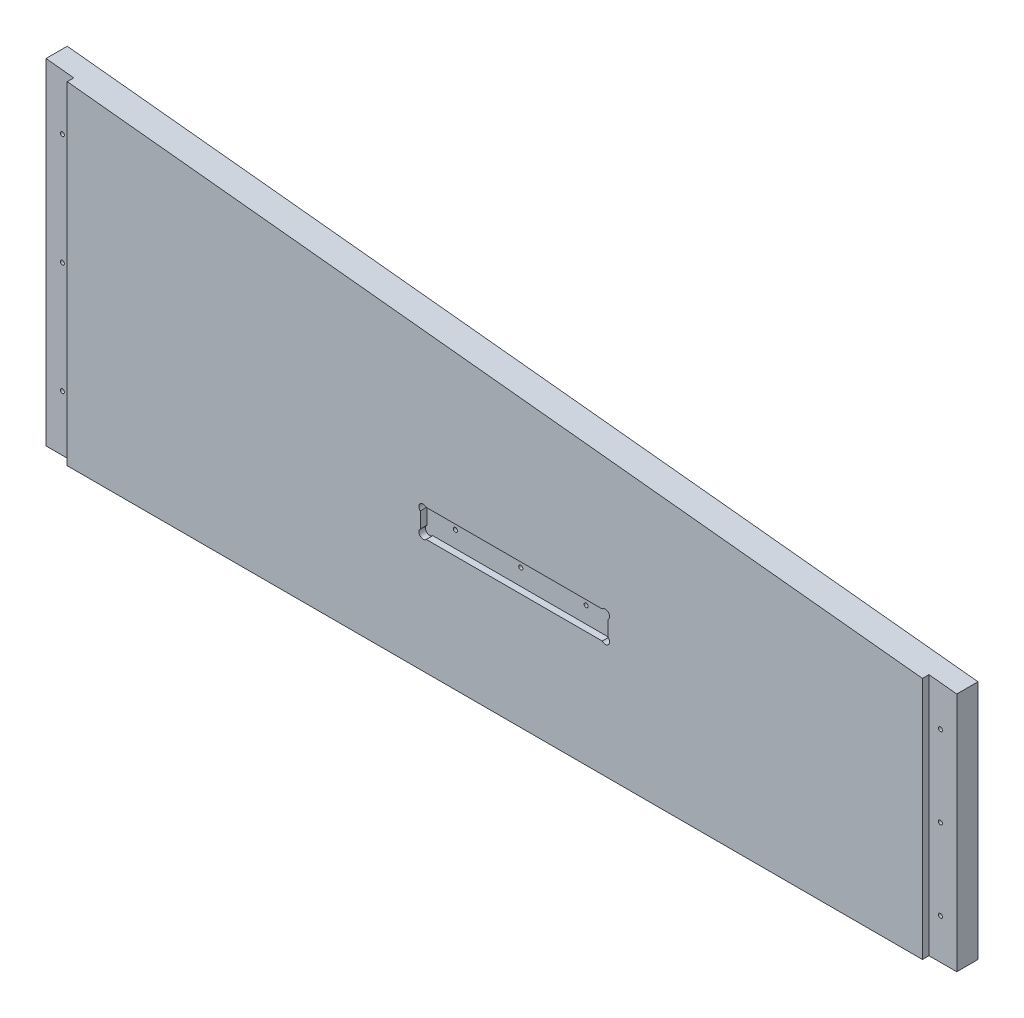
ISO-10303-21;
HEADER;
FILE_DESCRIPTION(('STEP AP214'),'2;1');
FILE_NAME('part.step','',(''),(''),'','','');
FILE_SCHEMA(('AUTOMOTIVE_DESIGN { 1 0 10303 214 1 1 1 1 }'));
ENDSEC;
DATA;
#1=APPLICATION_CONTEXT('core data for automotive mechanical design processes');
#2=APPLICATION_PROTOCOL_DEFINITION('international standard','automotive_design',2000,#1);
#3=PRODUCT_CONTEXT('',#1,'mechanical');
#4=PRODUCT('Part','Part','',(#3));
#5=PRODUCT_RELATED_PRODUCT_CATEGORY('part','',(#4));
#6=PRODUCT_DEFINITION_FORMATION('','',#4);
#7=PRODUCT_DEFINITION_CONTEXT('part definition',#1,'design');
#8=PRODUCT_DEFINITION('design','',#6,#7);
#9=PRODUCT_DEFINITION_SHAPE('','',#8);
#10=(LENGTH_UNIT() NAMED_UNIT(*) SI_UNIT(.MILLI.,.METRE.));
#11=(NAMED_UNIT(*) PLANE_ANGLE_UNIT() SI_UNIT($,.RADIAN.));
#12=(NAMED_UNIT(*) SI_UNIT($,.STERADIAN.) SOLID_ANGLE_UNIT());
#13=UNCERTAINTY_MEASURE_WITH_UNIT(LENGTH_MEASURE(1.E-05),#10,'distance_accuracy_value','');
#14=(GEOMETRIC_REPRESENTATION_CONTEXT(3) GLOBAL_UNCERTAINTY_ASSIGNED_CONTEXT((#13)) GLOBAL_UNIT_ASSIGNED_CONTEXT((#10,
#11,#12)) REPRESENTATION_CONTEXT('',''));
#15=CARTESIAN_POINT('',(0.,0.,0.));
#16=DIRECTION('',(0.,0.,1.));
#17=DIRECTION('',(1.,0.,0.));
#18=AXIS2_PLACEMENT_3D('',#15,#16,#17);
#19=CARTESIAN_POINT('',(471.4875,-5910.834,-26.080128060535));
#20=DIRECTION('',(0.,0.,1.));
#21=DIRECTION('',(1.,0.,0.));
#22=AXIS2_PLACEMENT_3D('',#19,#20,#21);
#23=CYLINDRICAL_SURFACE('',#22,1.58750000000001);
#24=CARTESIAN_POINT('',(471.4875,-5910.834,-21.59));
#25=DIRECTION('',(0.,0.,1.));
#26=DIRECTION('',(1.,0.,0.));
#27=AXIS2_PLACEMENT_3D('',#24,#25,#26);
#28=CIRCLE('',#27,1.58750000000001);
#29=CARTESIAN_POINT('',(473.075,-5910.834,-21.59));
#30=VERTEX_POINT('',#29);
#31=EDGE_CURVE('E197',#30,#30,#28,.F.);
#32=ORIENTED_EDGE('',*,*,#31,.T.);
#33=EDGE_LOOP('',(#32));
#34=FACE_BOUND('',#33,.T.);
#35=CARTESIAN_POINT('',(471.4875,-5910.834,-5.08));
#36=DIRECTION('',(0.,0.,1.));
#37=DIRECTION('',(1.,0.,0.));
#38=AXIS2_PLACEMENT_3D('',#35,#36,#37);
#39=CIRCLE('',#38,1.58750000000001);
#40=CARTESIAN_POINT('',(473.075,-5910.834,-5.08));
#41=VERTEX_POINT('',#40);
#42=EDGE_CURVE('E188',#41,#41,#39,.F.);
#43=ORIENTED_EDGE('',*,*,#42,.F.);
#44=EDGE_LOOP('',(#43));
#45=FACE_BOUND('',#44,.T.);
#46=ADVANCED_FACE('F31',(#34,#45),#23,.F.);
#47=CARTESIAN_POINT('',(522.2875,-5910.834,-26.080128060535));
#48=DIRECTION('',(0.,0.,1.));
#49=DIRECTION('',(1.,0.,0.));
#50=AXIS2_PLACEMENT_3D('',#47,#48,#49);
#51=CYLINDRICAL_SURFACE('',#50,1.58749999999985);
#52=CARTESIAN_POINT('',(522.2875,-5910.834,-21.59));
#53=DIRECTION('',(0.,0.,1.));
#54=DIRECTION('',(1.,0.,0.));
#55=AXIS2_PLACEMENT_3D('',#52,#53,#54);
#56=CIRCLE('',#55,1.58749999999985);
#57=CARTESIAN_POINT('',(523.875,-5910.834,-21.59));
#58=VERTEX_POINT('',#57);
#59=EDGE_CURVE('E194',#58,#58,#56,.F.);
#60=ORIENTED_EDGE('',*,*,#59,.T.);
#61=EDGE_LOOP('',(#60));
#62=FACE_BOUND('',#61,.T.);
#63=CARTESIAN_POINT('',(522.2875,-5910.834,-5.08));
#64=DIRECTION('',(0.,0.,1.));
#65=DIRECTION('',(1.,0.,0.));
#66=AXIS2_PLACEMENT_3D('',#63,#64,#65);
#67=CIRCLE('',#66,1.58749999999985);
#68=CARTESIAN_POINT('',(523.875,-5910.834,-5.08));
#69=VERTEX_POINT('',#68);
#70=EDGE_CURVE('E185',#69,#69,#67,.F.);
#71=ORIENTED_EDGE('',*,*,#70,.F.);
#72=EDGE_LOOP('',(#71));
#73=FACE_BOUND('',#72,.T.);
#74=ADVANCED_FACE('F320',(#62,#73),#51,.F.);
#75=CARTESIAN_POINT('',(573.0875,-5910.834,-26.080128060535));
#76=DIRECTION('',(0.,0.,1.));
#77=DIRECTION('',(1.,0.,0.));
#78=AXIS2_PLACEMENT_3D('',#75,#76,#77);
#79=CYLINDRICAL_SURFACE('',#78,1.58749999999996);
#80=CARTESIAN_POINT('',(573.0875,-5910.834,-21.59));
#81=DIRECTION('',(0.,0.,1.));
#82=DIRECTION('',(1.,0.,0.));
#83=AXIS2_PLACEMENT_3D('',#80,#81,#82);
#84=CIRCLE('',#83,1.58749999999996);
#85=CARTESIAN_POINT('',(574.675,-5910.834,-21.59));
#86=VERTEX_POINT('',#85);
#87=EDGE_CURVE('E191',#86,#86,#84,.F.);
#88=ORIENTED_EDGE('',*,*,#87,.T.);
#89=EDGE_LOOP('',(#88));
#90=FACE_BOUND('',#89,.T.);
#91=CARTESIAN_POINT('',(573.0875,-5910.834,-5.08));
#92=DIRECTION('',(0.,0.,1.));
#93=DIRECTION('',(1.,0.,0.));
#94=AXIS2_PLACEMENT_3D('',#91,#92,#93);
#95=CIRCLE('',#94,1.58749999999996);
#96=CARTESIAN_POINT('',(574.675,-5910.834,-5.08));
#97=VERTEX_POINT('',#96);
#98=EDGE_CURVE('E169',#97,#97,#95,.F.);
#99=ORIENTED_EDGE('',*,*,#98,.F.);
#100=EDGE_LOOP('',(#99));
#101=FACE_BOUND('',#100,.T.);
#102=ADVANCED_FACE('F326',(#90,#101),#79,.F.);
#103=CARTESIAN_POINT('',(839.47,-6013.45,-21.59));
#104=DIRECTION('',(1.,0.,0.));
#105=DIRECTION('',(0.,0.,-1.));
#106=AXIS2_PLACEMENT_3D('',#103,#104,#105);
#107=PLANE('',#106);
#108=DIRECTION('',(0.,0.,1.));
#109=VECTOR('',#108,1.);
#110=CARTESIAN_POINT('',(839.47,-6013.45,-21.59));
#111=LINE('',#110,#109);
#112=CARTESIAN_POINT('',(839.47,-6013.45,-5.08));
#113=VERTEX_POINT('',#112);
#114=CARTESIAN_POINT('',(839.47,-6013.45,0.));
#115=VERTEX_POINT('',#114);
#116=EDGE_CURVE('E398',#113,#115,#111,.T.);
#117=ORIENTED_EDGE('',*,*,#116,.F.);
#118=DIRECTION('',(0.,1.,0.));
#119=VECTOR('',#118,1.);
#120=CARTESIAN_POINT('',(839.47,-5824.2703968254,-5.08));
#121=LINE('',#120,#119);
#122=CARTESIAN_POINT('',(839.47,-5824.2703968254,-5.08));
#123=VERTEX_POINT('',#122);
#124=EDGE_CURVE('E229',#113,#123,#121,.T.);
#125=ORIENTED_EDGE('',*,*,#124,.T.);
#126=DIRECTION('',(0.,0.,1.));
#127=VECTOR('',#126,1.);
#128=CARTESIAN_POINT('',(839.47,-5824.2703968254,-21.59));
#129=LINE('',#128,#127);
#130=CARTESIAN_POINT('',(839.47,-5824.2703968254,0.));
#131=VERTEX_POINT('',#130);
#132=EDGE_CURVE('E233',#123,#131,#129,.T.);
#133=ORIENTED_EDGE('',*,*,#132,.T.);
#134=DIRECTION('',(0.,1.,0.));
#135=VECTOR('',#134,1.);
#136=CARTESIAN_POINT('',(839.47,-6013.45,0.));
#137=LINE('',#136,#135);
#138=EDGE_CURVE('E401',#115,#131,#137,.T.);
#139=ORIENTED_EDGE('',*,*,#138,.F.);
#140=EDGE_LOOP('',(#117,#125,#133,#139));
#141=FACE_BOUND('',#140,.T.);
#142=ADVANCED_FACE('F383',(#141),#107,.T.);
#143=CARTESIAN_POINT('',(174.9425,-5754.9546031746,-21.59));
#144=DIRECTION('',(-1.,0.,0.));
#145=DIRECTION('',(0.,-1.,0.));
#146=AXIS2_PLACEMENT_3D('',#143,#144,#145);
#147=PLANE('',#146);
#148=DIRECTION('',(0.,0.,1.));
#149=VECTOR('',#148,1.);
#150=CARTESIAN_POINT('',(174.9425,-5754.9546031746,-21.59));
#151=LINE('',#150,#149);
#152=CARTESIAN_POINT('',(174.9425,-5754.9546031746,-5.08));
#153=VERTEX_POINT('',#152);
#154=CARTESIAN_POINT('',(174.9425,-5754.9546031746,0.));
#155=VERTEX_POINT('',#154);
#156=EDGE_CURVE('E263',#153,#155,#151,.T.);
#157=ORIENTED_EDGE('',*,*,#156,.F.);
#158=DIRECTION('',(0.,-1.,0.));
#159=VECTOR('',#158,1.);
#160=CARTESIAN_POINT('',(174.9425,-5754.9546031746,-5.08));
#161=LINE('',#160,#159);
#162=CARTESIAN_POINT('',(174.9425,-6013.45,-5.08));
#163=VERTEX_POINT('',#162);
#164=EDGE_CURVE('E430',#153,#163,#161,.T.);
#165=ORIENTED_EDGE('',*,*,#164,.T.);
#166=DIRECTION('',(0.,0.,1.));
#167=VECTOR('',#166,1.);
#168=CARTESIAN_POINT('',(174.9425,-6013.45,-21.59));
#169=LINE('',#168,#167);
#170=CARTESIAN_POINT('',(174.9425,-6013.45,0.));
#171=VERTEX_POINT('',#170);
#172=EDGE_CURVE('E396',#163,#171,#169,.T.);
#173=ORIENTED_EDGE('',*,*,#172,.T.);
#174=DIRECTION('',(0.,-1.,0.));
#175=VECTOR('',#174,1.);
#176=CARTESIAN_POINT('',(174.9425,-5754.9546031746,0.));
#177=LINE('',#176,#175);
#178=EDGE_CURVE('E402',#155,#171,#177,.T.);
#179=ORIENTED_EDGE('',*,*,#178,.F.);
#180=EDGE_LOOP('',(#157,#165,#173,#179));
#181=FACE_BOUND('',#180,.T.);
#182=ADVANCED_FACE('F33',(#181),#147,.T.);
#183=CARTESIAN_POINT('',(839.47,-5824.2703968254,-21.59));
#184=DIRECTION('',(0.10374552875936,0.994603873540839,0.));
#185=DIRECTION('',(-0.994603873540839,0.10374552875936,0.));
#186=AXIS2_PLACEMENT_3D('',#183,#184,#185);
#187=PLANE('',#186);
#188=DIRECTION('',(-0.994603873540839,0.10374552875936,0.));
#189=VECTOR('',#188,1.);
#190=CARTESIAN_POINT('',(839.47,-5824.2703968254,0.));
#191=LINE('',#190,#189);
#192=EDGE_CURVE('E407',#131,#155,#191,.T.);
#193=ORIENTED_EDGE('',*,*,#192,.F.);
#194=ORIENTED_EDGE('',*,*,#132,.F.);
#195=DIRECTION('',(0.994603873540837,-0.103745528759374,0.));
#196=VECTOR('',#195,1.);
#197=CARTESIAN_POINT('',(861.06,-5826.52241496599,-5.08));
#198=LINE('',#197,#196);
#199=CARTESIAN_POINT('',(861.06,-5826.52241496599,-5.08));
#200=VERTEX_POINT('',#199);
#201=EDGE_CURVE('E54',#123,#200,#198,.T.);
#202=ORIENTED_EDGE('',*,*,#201,.T.);
#203=DIRECTION('',(0.,0.,-1.));
#204=VECTOR('',#203,1.);
#205=CARTESIAN_POINT('',(861.06,-5826.52241496599,-5.08));
#206=LINE('',#205,#204);
#207=CARTESIAN_POINT('',(861.06,-5826.52241496599,-21.59));
#208=VERTEX_POINT('',#207);
#209=EDGE_CURVE('E242',#200,#208,#206,.T.);
#210=ORIENTED_EDGE('',*,*,#209,.T.);
#211=DIRECTION('',(-0.994603873540839,0.10374552875936,0.));
#212=VECTOR('',#211,1.);
#213=CARTESIAN_POINT('',(839.47,-5824.2703968254,-21.59));
#214=LINE('',#213,#212);
#215=CARTESIAN_POINT('',(153.3525,-5752.70258503401,-21.59));
#216=VERTEX_POINT('',#215);
#217=EDGE_CURVE('E416',#208,#216,#214,.T.);
#218=ORIENTED_EDGE('',*,*,#217,.T.);
#219=DIRECTION('',(0.,0.,-1.));
#220=VECTOR('',#219,1.);
#221=CARTESIAN_POINT('',(153.3525,-5752.70258503401,-5.08));
#222=LINE('',#221,#220);
#223=CARTESIAN_POINT('',(153.3525,-5752.70258503401,-5.08));
#224=VERTEX_POINT('',#223);
#225=EDGE_CURVE('E410',#224,#216,#222,.T.);
#226=ORIENTED_EDGE('',*,*,#225,.F.);
#227=DIRECTION('',(0.994603873540837,-0.103745528759375,0.));
#228=VECTOR('',#227,1.);
#229=CARTESIAN_POINT('',(153.3525,-5752.70258503401,-5.08));
#230=LINE('',#229,#228);
#231=EDGE_CURVE('E444',#224,#153,#230,.T.);
#232=ORIENTED_EDGE('',*,*,#231,.T.);
#233=ORIENTED_EDGE('',*,*,#156,.T.);
#234=EDGE_LOOP('',(#193,#194,#202,#210,#218,#226,#232,#233));
#235=FACE_BOUND('',#234,.T.);
#236=ADVANCED_FACE('F379',(#235),#187,.T.);
#237=CARTESIAN_POINT('',(174.9425,-6013.45,-21.59));
#238=DIRECTION('',(0.,-1.,0.));
#239=DIRECTION('',(0.,0.,-1.));
#240=AXIS2_PLACEMENT_3D('',#237,#238,#239);
#241=PLANE('',#240);
#242=DIRECTION('',(1.,0.,0.));
#243=VECTOR('',#242,1.);
#244=CARTESIAN_POINT('',(174.9425,-6013.45,0.));
#245=LINE('',#244,#243);
#246=EDGE_CURVE('E393',#171,#115,#245,.T.);
#247=ORIENTED_EDGE('',*,*,#246,.F.);
#248=ORIENTED_EDGE('',*,*,#172,.F.);
#249=DIRECTION('',(-1.,0.,0.));
#250=VECTOR('',#249,1.);
#251=CARTESIAN_POINT('',(174.9425,-6013.45,-5.08));
#252=LINE('',#251,#250);
#253=CARTESIAN_POINT('',(153.3525,-6013.45,-5.08));
#254=VERTEX_POINT('',#253);
#255=EDGE_CURVE('E434',#163,#254,#252,.T.);
#256=ORIENTED_EDGE('',*,*,#255,.T.);
#257=DIRECTION('',(0.,0.,-1.));
#258=VECTOR('',#257,1.);
#259=CARTESIAN_POINT('',(153.3525,-6013.45,-5.08));
#260=LINE('',#259,#258);
#261=CARTESIAN_POINT('',(153.3525,-6013.45,-21.59));
#262=VERTEX_POINT('',#261);
#263=EDGE_CURVE('E413',#254,#262,#260,.T.);
#264=ORIENTED_EDGE('',*,*,#263,.T.);
#265=DIRECTION('',(1.,0.,0.));
#266=VECTOR('',#265,1.);
#267=CARTESIAN_POINT('',(174.9425,-6013.45,-21.59));
#268=LINE('',#267,#266);
#269=CARTESIAN_POINT('',(861.06,-6013.45,-21.59));
#270=VERTEX_POINT('',#269);
#271=EDGE_CURVE('E421',#262,#270,#268,.T.);
#272=ORIENTED_EDGE('',*,*,#271,.T.);
#273=DIRECTION('',(0.,0.,-1.));
#274=VECTOR('',#273,1.);
#275=CARTESIAN_POINT('',(861.06,-6013.45,-5.08));
#276=LINE('',#275,#274);
#277=CARTESIAN_POINT('',(861.06,-6013.45,-5.08));
#278=VERTEX_POINT('',#277);
#279=EDGE_CURVE('E446',#278,#270,#276,.T.);
#280=ORIENTED_EDGE('',*,*,#279,.F.);
#281=DIRECTION('',(-1.,0.,0.));
#282=VECTOR('',#281,1.);
#283=CARTESIAN_POINT('',(839.47,-6013.45,-5.08));
#284=LINE('',#283,#282);
#285=EDGE_CURVE('E239',#278,#113,#284,.T.);
#286=ORIENTED_EDGE('',*,*,#285,.T.);
#287=ORIENTED_EDGE('',*,*,#116,.T.);
#288=EDGE_LOOP('',(#247,#248,#256,#264,#272,#280,#286,#287));
#289=FACE_BOUND('',#288,.T.);
#290=ADVANCED_FACE('F375',(#289),#241,.T.);
#291=CARTESIAN_POINT('',(174.9425,-6013.45,-21.59));
#292=DIRECTION('',(0.,0.,1.));
#293=DIRECTION('',(1.,0.,0.));
#294=AXIS2_PLACEMENT_3D('',#291,#292,#293);
#295=PLANE('',#294);
#296=ORIENTED_EDGE('',*,*,#87,.F.);
#297=EDGE_LOOP('',(#296));
#298=FACE_BOUND('',#297,.T.);
#299=ORIENTED_EDGE('',*,*,#59,.F.);
#300=EDGE_LOOP('',(#299));
#301=FACE_BOUND('',#300,.T.);
#302=ORIENTED_EDGE('',*,*,#31,.F.);
#303=EDGE_LOOP('',(#302));
#304=FACE_BOUND('',#303,.T.);
#305=CARTESIAN_POINT('',(848.36,-5856.57308200948,-21.59));
#306=DIRECTION('',(0.,0.,1.));
#307=DIRECTION('',(1.,0.,0.));
#308=AXIS2_PLACEMENT_3D('',#305,#306,#307);
#309=CIRCLE('',#308,1.58749999999964);
#310=CARTESIAN_POINT('',(849.9475,-5856.57308200948,-21.59));
#311=VERTEX_POINT('',#310);
#312=EDGE_CURVE('E200',#311,#311,#309,.F.);
#313=ORIENTED_EDGE('',*,*,#312,.F.);
#314=EDGE_LOOP('',(#313));
#315=FACE_BOUND('',#314,.T.);
#316=CARTESIAN_POINT('',(848.36,-5919.32384920518,-21.59));
#317=DIRECTION('',(0.,0.,1.));
#318=DIRECTION('',(1.,0.,0.));
#319=AXIS2_PLACEMENT_3D('',#316,#317,#318);
#320=CIRCLE('',#319,1.58749999999974);
#321=CARTESIAN_POINT('',(849.9475,-5919.32384920518,-21.59));
#322=VERTEX_POINT('',#321);
#323=EDGE_CURVE('E204',#322,#322,#320,.F.);
#324=ORIENTED_EDGE('',*,*,#323,.F.);
#325=EDGE_LOOP('',(#324));
#326=FACE_BOUND('',#325,.T.);
#327=CARTESIAN_POINT('',(848.36,-5982.07461640088,-21.59));
#328=DIRECTION('',(0.,0.,1.));
#329=DIRECTION('',(1.,0.,0.));
#330=AXIS2_PLACEMENT_3D('',#327,#328,#329);
#331=CIRCLE('',#330,1.58749999999974);
#332=CARTESIAN_POINT('',(849.9475,-5982.07461640088,-21.59));
#333=VERTEX_POINT('',#332);
#334=EDGE_CURVE('E208',#333,#333,#331,.F.);
#335=ORIENTED_EDGE('',*,*,#334,.F.);
#336=EDGE_LOOP('',(#335));
#337=FACE_BOUND('',#336,.T.);
#338=CARTESIAN_POINT('',(166.0525,-5797.26441799052,-21.59));
#339=DIRECTION('',(0.,0.,1.));
#340=DIRECTION('',(1.,0.,0.));
#341=AXIS2_PLACEMENT_3D('',#338,#339,#340);
#342=CIRCLE('',#341,1.58749999999977);
#343=CARTESIAN_POINT('',(167.64,-5797.26441799052,-21.59));
#344=VERTEX_POINT('',#343);
#345=EDGE_CURVE('E212',#344,#344,#342,.F.);
#346=ORIENTED_EDGE('',*,*,#345,.F.);
#347=EDGE_LOOP('',(#346));
#348=FACE_BOUND('',#347,.T.);
#349=CARTESIAN_POINT('',(166.0525,-5883.73865079482,-21.59));
#350=DIRECTION('',(0.,0.,1.));
#351=DIRECTION('',(1.,0.,0.));
#352=AXIS2_PLACEMENT_3D('',#349,#350,#351);
#353=CIRCLE('',#352,1.5874999999999);
#354=CARTESIAN_POINT('',(167.64,-5883.73865079482,-21.59));
#355=VERTEX_POINT('',#354);
#356=EDGE_CURVE('E216',#355,#355,#353,.F.);
#357=ORIENTED_EDGE('',*,*,#356,.F.);
#358=EDGE_LOOP('',(#357));
#359=FACE_BOUND('',#358,.T.);
#360=CARTESIAN_POINT('',(166.0525,-5970.21288359912,-21.59));
#361=DIRECTION('',(0.,0.,1.));
#362=DIRECTION('',(1.,0.,0.));
#363=AXIS2_PLACEMENT_3D('',#360,#361,#362);
#364=CIRCLE('',#363,1.58749999999977);
#365=CARTESIAN_POINT('',(167.64,-5970.21288359912,-21.59));
#366=VERTEX_POINT('',#365);
#367=EDGE_CURVE('E220',#366,#366,#364,.F.);
#368=ORIENTED_EDGE('',*,*,#367,.F.);
#369=EDGE_LOOP('',(#368));
#370=FACE_BOUND('',#369,.T.);
#371=ORIENTED_EDGE('',*,*,#271,.F.);
#372=DIRECTION('',(0.,1.,0.));
#373=VECTOR('',#372,1.);
#374=CARTESIAN_POINT('',(153.3525,-6013.45,-21.59));
#375=LINE('',#374,#373);
#376=EDGE_CURVE('E435',#262,#216,#375,.T.);
#377=ORIENTED_EDGE('',*,*,#376,.T.);
#378=ORIENTED_EDGE('',*,*,#217,.F.);
#379=DIRECTION('',(0.,-1.,0.));
#380=VECTOR('',#379,1.);
#381=CARTESIAN_POINT('',(861.06,-6013.45,-21.59));
#382=LINE('',#381,#380);
#383=EDGE_CURVE('E232',#208,#270,#382,.T.);
#384=ORIENTED_EDGE('',*,*,#383,.T.);
#385=EDGE_LOOP('',(#371,#377,#378,#384));
#386=FACE_BOUND('',#385,.T.);
#387=ADVANCED_FACE('F372',(#298,#301,#304,#315,#326,#337,#348,#359,#370,#386),#295,.F.);
#388=CARTESIAN_POINT('',(174.9425,-6013.45,0.));
#389=DIRECTION('',(0.,0.,1.));
#390=DIRECTION('',(1.,0.,0.));
#391=AXIS2_PLACEMENT_3D('',#388,#389,#390);
#392=PLANE('',#391);
#393=CARTESIAN_POINT('',(593.06743597096,-5904.18906403027,0.));
#394=DIRECTION('',(0.,0.,1.));
#395=DIRECTION('',(1.,0.,0.));
#396=AXIS2_PLACEMENT_3D('',#393,#394,#395);
#397=CIRCLE('',#396,3.30200000000012);
#398=CARTESIAN_POINT('',(595.312500001227,-5906.61040487781,0.));
#399=VERTEX_POINT('',#398);
#400=CARTESIAN_POINT('',(590.646095123413,-5901.944,0.));
#401=VERTEX_POINT('',#400);
#402=EDGE_CURVE('E152',#399,#401,#397,.T.);
#403=ORIENTED_EDGE('',*,*,#402,.F.);
#404=DIRECTION('',(0.,1.,0.));
#405=VECTOR('',#404,1.);
#406=CARTESIAN_POINT('',(595.312500001227,-5901.944,0.));
#407=LINE('',#406,#405);
#408=CARTESIAN_POINT('',(595.312500001227,-5918.86759512218,0.));
#409=VERTEX_POINT('',#408);
#410=EDGE_CURVE('E161',#409,#399,#407,.T.);
#411=ORIENTED_EDGE('',*,*,#410,.F.);
#412=CARTESIAN_POINT('',(593.067435970959,-5921.28893596973,0.));
#413=DIRECTION('',(0.,0.,1.));
#414=DIRECTION('',(1.,0.,0.));
#415=AXIS2_PLACEMENT_3D('',#412,#413,#414);
#416=CIRCLE('',#415,3.30199999999986);
#417=CARTESIAN_POINT('',(590.646095123413,-5923.534,0.));
#418=VERTEX_POINT('',#417);
#419=EDGE_CURVE('E273',#418,#409,#416,.T.);
#420=ORIENTED_EDGE('',*,*,#419,.F.);
#421=DIRECTION('',(1.,0.,0.));
#422=VECTOR('',#421,1.);
#423=CARTESIAN_POINT('',(449.262499998773,-5923.534,0.));
#424=LINE('',#423,#422);
#425=CARTESIAN_POINT('',(453.928904876586,-5923.534,0.));
#426=VERTEX_POINT('',#425);
#427=EDGE_CURVE('E178',#426,#418,#424,.T.);
#428=ORIENTED_EDGE('',*,*,#427,.F.);
#429=CARTESIAN_POINT('',(451.50756402904,-5921.28893596973,0.));
#430=DIRECTION('',(0.,0.,1.));
#431=DIRECTION('',(1.,0.,0.));
#432=AXIS2_PLACEMENT_3D('',#429,#430,#431);
#433=CIRCLE('',#432,3.30199999999996);
#434=CARTESIAN_POINT('',(449.262499998773,-5918.86759512218,0.));
#435=VERTEX_POINT('',#434);
#436=EDGE_CURVE('E284',#435,#426,#433,.T.);
#437=ORIENTED_EDGE('',*,*,#436,.F.);
#438=DIRECTION('',(0.,-1.,0.));
#439=VECTOR('',#438,1.);
#440=CARTESIAN_POINT('',(449.262499998773,-5901.944,0.));
#441=LINE('',#440,#439);
#442=CARTESIAN_POINT('',(449.262499998773,-5906.61040487781,0.));
#443=VERTEX_POINT('',#442);
#444=EDGE_CURVE('E175',#443,#435,#441,.T.);
#445=ORIENTED_EDGE('',*,*,#444,.F.);
#446=CARTESIAN_POINT('',(451.50756402904,-5904.18906403027,0.));
#447=DIRECTION('',(0.,0.,1.));
#448=DIRECTION('',(1.,0.,0.));
#449=AXIS2_PLACEMENT_3D('',#446,#447,#448);
#450=CIRCLE('',#449,3.30199999999943);
#451=CARTESIAN_POINT('',(453.928904876586,-5901.944,0.));
#452=VERTEX_POINT('',#451);
#453=EDGE_CURVE('E290',#452,#443,#450,.T.);
#454=ORIENTED_EDGE('',*,*,#453,.F.);
#455=DIRECTION('',(-1.,0.,0.));
#456=VECTOR('',#455,1.);
#457=CARTESIAN_POINT('',(449.262499998773,-5901.944,0.));
#458=LINE('',#457,#456);
#459=EDGE_CURVE('E183',#401,#452,#458,.T.);
#460=ORIENTED_EDGE('',*,*,#459,.F.);
#461=EDGE_LOOP('',(#403,#411,#420,#428,#437,#445,#454,#460));
#462=FACE_BOUND('',#461,.T.);
#463=ORIENTED_EDGE('',*,*,#178,.T.);
#464=ORIENTED_EDGE('',*,*,#246,.T.);
#465=ORIENTED_EDGE('',*,*,#138,.T.);
#466=ORIENTED_EDGE('',*,*,#192,.T.);
#467=EDGE_LOOP('',(#463,#464,#465,#466));
#468=FACE_BOUND('',#467,.T.);
#469=ADVANCED_FACE('F275',(#462,#468),#392,.T.);
#470=CARTESIAN_POINT('',(153.3525,-6013.45,-5.08));
#471=DIRECTION('',(-1.,0.,0.));
#472=DIRECTION('',(0.,0.,1.));
#473=AXIS2_PLACEMENT_3D('',#470,#471,#472);
#474=PLANE('',#473);
#475=ORIENTED_EDGE('',*,*,#376,.F.);
#476=ORIENTED_EDGE('',*,*,#263,.F.);
#477=DIRECTION('',(0.,1.,0.));
#478=VECTOR('',#477,1.);
#479=CARTESIAN_POINT('',(153.3525,-6013.45,-5.08));
#480=LINE('',#479,#478);
#481=EDGE_CURVE('E441',#254,#224,#480,.T.);
#482=ORIENTED_EDGE('',*,*,#481,.T.);
#483=ORIENTED_EDGE('',*,*,#225,.T.);
#484=EDGE_LOOP('',(#475,#476,#482,#483));
#485=FACE_BOUND('',#484,.T.);
#486=ADVANCED_FACE('F367',(#485),#474,.T.);
#487=CARTESIAN_POINT('',(174.9425,-6013.45,-5.08));
#488=DIRECTION('',(0.,0.,-1.));
#489=DIRECTION('',(-1.,0.,0.));
#490=AXIS2_PLACEMENT_3D('',#487,#488,#489);
#491=PLANE('',#490);
#492=CARTESIAN_POINT('',(166.0525,-5797.26441799052,-5.08));
#493=DIRECTION('',(0.,0.,-1.));
#494=DIRECTION('',(-1.,0.,0.));
#495=AXIS2_PLACEMENT_3D('',#492,#493,#494);
#496=CIRCLE('',#495,1.58749999999977);
#497=CARTESIAN_POINT('',(164.465,-5797.26441799052,-5.08));
#498=VERTEX_POINT('',#497);
#499=EDGE_CURVE('E215',#498,#498,#496,.T.);
#500=ORIENTED_EDGE('',*,*,#499,.T.);
#501=EDGE_LOOP('',(#500));
#502=FACE_BOUND('',#501,.T.);
#503=CARTESIAN_POINT('',(166.0525,-5883.73865079482,-5.08));
#504=DIRECTION('',(0.,0.,-1.));
#505=DIRECTION('',(-1.,0.,0.));
#506=AXIS2_PLACEMENT_3D('',#503,#504,#505);
#507=CIRCLE('',#506,1.5874999999999);
#508=CARTESIAN_POINT('',(164.465,-5883.73865079482,-5.08));
#509=VERTEX_POINT('',#508);
#510=EDGE_CURVE('E219',#509,#509,#507,.T.);
#511=ORIENTED_EDGE('',*,*,#510,.T.);
#512=EDGE_LOOP('',(#511));
#513=FACE_BOUND('',#512,.T.);
#514=CARTESIAN_POINT('',(166.0525,-5970.21288359912,-5.08));
#515=DIRECTION('',(0.,0.,-1.));
#516=DIRECTION('',(-1.,0.,0.));
#517=AXIS2_PLACEMENT_3D('',#514,#515,#516);
#518=CIRCLE('',#517,1.58749999999977);
#519=CARTESIAN_POINT('',(164.465,-5970.21288359912,-5.08));
#520=VERTEX_POINT('',#519);
#521=EDGE_CURVE('E223',#520,#520,#518,.T.);
#522=ORIENTED_EDGE('',*,*,#521,.T.);
#523=EDGE_LOOP('',(#522));
#524=FACE_BOUND('',#523,.T.);
#525=ORIENTED_EDGE('',*,*,#164,.F.);
#526=ORIENTED_EDGE('',*,*,#231,.F.);
#527=ORIENTED_EDGE('',*,*,#481,.F.);
#528=ORIENTED_EDGE('',*,*,#255,.F.);
#529=EDGE_LOOP('',(#525,#526,#527,#528));
#530=FACE_BOUND('',#529,.T.);
#531=ADVANCED_FACE('F363',(#502,#513,#524,#530),#491,.F.);
#532=CARTESIAN_POINT('',(861.06,-6013.45,-5.08));
#533=DIRECTION('',(1.,0.,0.));
#534=DIRECTION('',(0.,0.,-1.));
#535=AXIS2_PLACEMENT_3D('',#532,#533,#534);
#536=PLANE('',#535);
#537=ORIENTED_EDGE('',*,*,#383,.F.);
#538=ORIENTED_EDGE('',*,*,#209,.F.);
#539=DIRECTION('',(0.,-1.,0.));
#540=VECTOR('',#539,1.);
#541=CARTESIAN_POINT('',(861.06,-6013.45,-5.08));
#542=LINE('',#541,#540);
#543=EDGE_CURVE('E226',#200,#278,#542,.T.);
#544=ORIENTED_EDGE('',*,*,#543,.T.);
#545=ORIENTED_EDGE('',*,*,#279,.T.);
#546=EDGE_LOOP('',(#537,#538,#544,#545));
#547=FACE_BOUND('',#546,.T.);
#548=ADVANCED_FACE('F359',(#547),#536,.T.);
#549=CARTESIAN_POINT('',(839.47,-6013.45,-5.08));
#550=DIRECTION('',(0.,0.,1.));
#551=DIRECTION('',(1.,0.,0.));
#552=AXIS2_PLACEMENT_3D('',#549,#550,#551);
#553=PLANE('',#552);
#554=CARTESIAN_POINT('',(848.36,-5856.57308200948,-5.08));
#555=DIRECTION('',(0.,0.,1.));
#556=DIRECTION('',(1.,0.,0.));
#557=AXIS2_PLACEMENT_3D('',#554,#555,#556);
#558=CIRCLE('',#557,1.58749999999964);
#559=CARTESIAN_POINT('',(849.9475,-5856.57308200948,-5.08));
#560=VERTEX_POINT('',#559);
#561=EDGE_CURVE('E203',#560,#560,#558,.T.);
#562=ORIENTED_EDGE('',*,*,#561,.F.);
#563=EDGE_LOOP('',(#562));
#564=FACE_BOUND('',#563,.T.);
#565=CARTESIAN_POINT('',(848.36,-5919.32384920518,-5.08));
#566=DIRECTION('',(0.,0.,1.));
#567=DIRECTION('',(1.,0.,0.));
#568=AXIS2_PLACEMENT_3D('',#565,#566,#567);
#569=CIRCLE('',#568,1.58749999999974);
#570=CARTESIAN_POINT('',(849.9475,-5919.32384920518,-5.08));
#571=VERTEX_POINT('',#570);
#572=EDGE_CURVE('E207',#571,#571,#569,.T.);
#573=ORIENTED_EDGE('',*,*,#572,.F.);
#574=EDGE_LOOP('',(#573));
#575=FACE_BOUND('',#574,.T.);
#576=CARTESIAN_POINT('',(848.36,-5982.07461640088,-5.08));
#577=DIRECTION('',(0.,0.,1.));
#578=DIRECTION('',(1.,0.,0.));
#579=AXIS2_PLACEMENT_3D('',#576,#577,#578);
#580=CIRCLE('',#579,1.58749999999974);
#581=CARTESIAN_POINT('',(849.9475,-5982.07461640088,-5.08));
#582=VERTEX_POINT('',#581);
#583=EDGE_CURVE('E211',#582,#582,#580,.T.);
#584=ORIENTED_EDGE('',*,*,#583,.F.);
#585=EDGE_LOOP('',(#584));
#586=FACE_BOUND('',#585,.T.);
#587=ORIENTED_EDGE('',*,*,#124,.F.);
#588=ORIENTED_EDGE('',*,*,#285,.F.);
#589=ORIENTED_EDGE('',*,*,#543,.F.);
#590=ORIENTED_EDGE('',*,*,#201,.F.);
#591=EDGE_LOOP('',(#587,#588,#589,#590));
#592=FACE_BOUND('',#591,.T.);
#593=ADVANCED_FACE('F355',(#564,#575,#586,#592),#553,.T.);
#594=CARTESIAN_POINT('',(166.0525,-5970.21288359912,-26.080128060535));
#595=DIRECTION('',(0.,0.,1.));
#596=DIRECTION('',(1.,0.,0.));
#597=AXIS2_PLACEMENT_3D('',#594,#595,#596);
#598=CYLINDRICAL_SURFACE('',#597,1.58749999999977);
#599=ORIENTED_EDGE('',*,*,#367,.T.);
#600=EDGE_LOOP('',(#599));
#601=FACE_BOUND('',#600,.T.);
#602=ORIENTED_EDGE('',*,*,#521,.F.);
#603=EDGE_LOOP('',(#602));
#604=FACE_BOUND('',#603,.T.);
#605=ADVANCED_FACE('F351',(#601,#604),#598,.F.);
#606=CARTESIAN_POINT('',(166.0525,-5883.73865079482,-26.080128060535));
#607=DIRECTION('',(0.,0.,1.));
#608=DIRECTION('',(1.,0.,0.));
#609=AXIS2_PLACEMENT_3D('',#606,#607,#608);
#610=CYLINDRICAL_SURFACE('',#609,1.5874999999999);
#611=ORIENTED_EDGE('',*,*,#356,.T.);
#612=EDGE_LOOP('',(#611));
#613=FACE_BOUND('',#612,.T.);
#614=ORIENTED_EDGE('',*,*,#510,.F.);
#615=EDGE_LOOP('',(#614));
#616=FACE_BOUND('',#615,.T.);
#617=ADVANCED_FACE('F347',(#613,#616),#610,.F.);
#618=CARTESIAN_POINT('',(166.0525,-5797.26441799052,-26.080128060535));
#619=DIRECTION('',(0.,0.,1.));
#620=DIRECTION('',(1.,0.,0.));
#621=AXIS2_PLACEMENT_3D('',#618,#619,#620);
#622=CYLINDRICAL_SURFACE('',#621,1.58749999999977);
#623=ORIENTED_EDGE('',*,*,#345,.T.);
#624=EDGE_LOOP('',(#623));
#625=FACE_BOUND('',#624,.T.);
#626=ORIENTED_EDGE('',*,*,#499,.F.);
#627=EDGE_LOOP('',(#626));
#628=FACE_BOUND('',#627,.T.);
#629=ADVANCED_FACE('F343',(#625,#628),#622,.F.);
#630=CARTESIAN_POINT('',(848.36,-5982.07461640088,-26.080128060535));
#631=DIRECTION('',(0.,0.,1.));
#632=DIRECTION('',(1.,0.,0.));
#633=AXIS2_PLACEMENT_3D('',#630,#631,#632);
#634=CYLINDRICAL_SURFACE('',#633,1.58749999999974);
#635=ORIENTED_EDGE('',*,*,#583,.T.);
#636=EDGE_LOOP('',(#635));
#637=FACE_BOUND('',#636,.T.);
#638=ORIENTED_EDGE('',*,*,#334,.T.);
#639=EDGE_LOOP('',(#638));
#640=FACE_BOUND('',#639,.T.);
#641=ADVANCED_FACE('F339',(#637,#640),#634,.F.);
#642=CARTESIAN_POINT('',(848.36,-5919.32384920518,-26.080128060535));
#643=DIRECTION('',(0.,0.,1.));
#644=DIRECTION('',(1.,0.,0.));
#645=AXIS2_PLACEMENT_3D('',#642,#643,#644);
#646=CYLINDRICAL_SURFACE('',#645,1.58749999999974);
#647=ORIENTED_EDGE('',*,*,#572,.T.);
#648=EDGE_LOOP('',(#647));
#649=FACE_BOUND('',#648,.T.);
#650=ORIENTED_EDGE('',*,*,#323,.T.);
#651=EDGE_LOOP('',(#650));
#652=FACE_BOUND('',#651,.T.);
#653=ADVANCED_FACE('F335',(#649,#652),#646,.F.);
#654=CARTESIAN_POINT('',(848.36,-5856.57308200948,-26.080128060535));
#655=DIRECTION('',(0.,0.,1.));
#656=DIRECTION('',(1.,0.,0.));
#657=AXIS2_PLACEMENT_3D('',#654,#655,#656);
#658=CYLINDRICAL_SURFACE('',#657,1.58749999999964);
#659=ORIENTED_EDGE('',*,*,#561,.T.);
#660=EDGE_LOOP('',(#659));
#661=FACE_BOUND('',#660,.T.);
#662=ORIENTED_EDGE('',*,*,#312,.T.);
#663=EDGE_LOOP('',(#662));
#664=FACE_BOUND('',#663,.T.);
#665=ADVANCED_FACE('F332',(#661,#664),#658,.F.);
#666=CARTESIAN_POINT('',(449.262499998773,-5923.534,-5.08));
#667=DIRECTION('',(0.,0.,1.));
#668=DIRECTION('',(1.,0.,0.));
#669=AXIS2_PLACEMENT_3D('',#666,#667,#668);
#670=PLANE('',#669);
#671=DIRECTION('',(0.,1.,0.));
#672=VECTOR('',#671,1.);
#673=CARTESIAN_POINT('',(595.312500001227,-5901.944,-5.08));
#674=LINE('',#673,#672);
#675=CARTESIAN_POINT('',(595.312500001227,-5918.86759512218,-5.08));
#676=VERTEX_POINT('',#675);
#677=CARTESIAN_POINT('',(595.312500001227,-5906.61040487781,-5.08));
#678=VERTEX_POINT('',#677);
#679=EDGE_CURVE('E159',#676,#678,#674,.T.);
#680=ORIENTED_EDGE('',*,*,#679,.T.);
#681=CARTESIAN_POINT('',(593.06743597096,-5904.18906403027,-5.08));
#682=DIRECTION('',(0.,0.,1.));
#683=DIRECTION('',(1.,0.,0.));
#684=AXIS2_PLACEMENT_3D('',#681,#682,#683);
#685=CIRCLE('',#684,3.30200000000012);
#686=CARTESIAN_POINT('',(590.646095123413,-5901.944,-5.08));
#687=VERTEX_POINT('',#686);
#688=EDGE_CURVE('E145',#687,#678,#685,.F.);
#689=ORIENTED_EDGE('',*,*,#688,.F.);
#690=DIRECTION('',(-1.,0.,0.));
#691=VECTOR('',#690,1.);
#692=CARTESIAN_POINT('',(449.262499998773,-5901.944,-5.08));
#693=LINE('',#692,#691);
#694=CARTESIAN_POINT('',(453.928904876586,-5901.944,-5.08));
#695=VERTEX_POINT('',#694);
#696=EDGE_CURVE('E166',#687,#695,#693,.T.);
#697=ORIENTED_EDGE('',*,*,#696,.T.);
#698=CARTESIAN_POINT('',(451.50756402904,-5904.18906403027,-5.08));
#699=DIRECTION('',(0.,0.,1.));
#700=DIRECTION('',(1.,0.,0.));
#701=AXIS2_PLACEMENT_3D('',#698,#699,#700);
#702=CIRCLE('',#701,3.30199999999943);
#703=CARTESIAN_POINT('',(449.262499998773,-5906.61040487781,-5.08));
#704=VERTEX_POINT('',#703);
#705=EDGE_CURVE('E292',#704,#695,#702,.F.);
#706=ORIENTED_EDGE('',*,*,#705,.F.);
#707=DIRECTION('',(0.,-1.,0.));
#708=VECTOR('',#707,1.);
#709=CARTESIAN_POINT('',(449.262499998773,-5901.944,-5.08));
#710=LINE('',#709,#708);
#711=CARTESIAN_POINT('',(449.262499998773,-5918.86759512218,-5.08));
#712=VERTEX_POINT('',#711);
#713=EDGE_CURVE('E171',#704,#712,#710,.T.);
#714=ORIENTED_EDGE('',*,*,#713,.T.);
#715=CARTESIAN_POINT('',(451.50756402904,-5921.28893596973,-5.08));
#716=DIRECTION('',(0.,0.,1.));
#717=DIRECTION('',(1.,0.,0.));
#718=AXIS2_PLACEMENT_3D('',#715,#716,#717);
#719=CIRCLE('',#718,3.30199999999996);
#720=CARTESIAN_POINT('',(453.928904876586,-5923.534,-5.08));
#721=VERTEX_POINT('',#720);
#722=EDGE_CURVE('E46',#721,#712,#719,.F.);
#723=ORIENTED_EDGE('',*,*,#722,.F.);
#724=DIRECTION('',(1.,0.,0.));
#725=VECTOR('',#724,1.);
#726=CARTESIAN_POINT('',(449.262499998773,-5923.534,-5.08));
#727=LINE('',#726,#725);
#728=CARTESIAN_POINT('',(590.646095123413,-5923.534,-5.08));
#729=VERTEX_POINT('',#728);
#730=EDGE_CURVE('E167',#721,#729,#727,.T.);
#731=ORIENTED_EDGE('',*,*,#730,.T.);
#732=CARTESIAN_POINT('',(593.067435970959,-5921.28893596973,-5.08));
#733=DIRECTION('',(0.,0.,1.));
#734=DIRECTION('',(1.,0.,0.));
#735=AXIS2_PLACEMENT_3D('',#732,#733,#734);
#736=CIRCLE('',#735,3.30199999999986);
#737=EDGE_CURVE('E165',#676,#729,#736,.F.);
#738=ORIENTED_EDGE('',*,*,#737,.F.);
#739=EDGE_LOOP('',(#680,#689,#697,#706,#714,#723,#731,#738));
#740=FACE_BOUND('',#739,.T.);
#741=ORIENTED_EDGE('',*,*,#70,.T.);
#742=EDGE_LOOP('',(#741));
#743=FACE_BOUND('',#742,.T.);
#744=ORIENTED_EDGE('',*,*,#98,.T.);
#745=EDGE_LOOP('',(#744));
#746=FACE_BOUND('',#745,.T.);
#747=ORIENTED_EDGE('',*,*,#42,.T.);
#748=EDGE_LOOP('',(#747));
#749=FACE_BOUND('',#748,.T.);
#750=ADVANCED_FACE('F163',(#740,#743,#746,#749),#670,.T.);
#751=CARTESIAN_POINT('',(449.262499998773,-5901.944,-5.08));
#752=DIRECTION('',(-1.,0.,0.));
#753=DIRECTION('',(0.,0.,1.));
#754=AXIS2_PLACEMENT_3D('',#751,#752,#753);
#755=PLANE('',#754);
#756=ORIENTED_EDGE('',*,*,#444,.T.);
#757=DIRECTION('',(0.,0.,1.));
#758=VECTOR('',#757,1.);
#759=CARTESIAN_POINT('',(449.262499998773,-5918.86759512218,-14.4194663659117));
#760=LINE('',#759,#758);
#761=EDGE_CURVE('E287',#435,#712,#760,.F.);
#762=ORIENTED_EDGE('',*,*,#761,.T.);
#763=ORIENTED_EDGE('',*,*,#713,.F.);
#764=DIRECTION('',(0.,0.,1.));
#765=VECTOR('',#764,1.);
#766=CARTESIAN_POINT('',(449.262499998773,-5906.61040487781,-14.4194663659117));
#767=LINE('',#766,#765);
#768=EDGE_CURVE('E179',#704,#443,#767,.T.);
#769=ORIENTED_EDGE('',*,*,#768,.T.);
#770=EDGE_LOOP('',(#756,#762,#763,#769));
#771=FACE_BOUND('',#770,.T.);
#772=ADVANCED_FACE('F299',(#771),#755,.F.);
#773=CARTESIAN_POINT('',(449.262499998773,-5901.944,-5.08));
#774=DIRECTION('',(0.,1.,0.));
#775=DIRECTION('',(0.,0.,1.));
#776=AXIS2_PLACEMENT_3D('',#773,#774,#775);
#777=PLANE('',#776);
#778=ORIENTED_EDGE('',*,*,#696,.F.);
#779=DIRECTION('',(0.,0.,1.));
#780=VECTOR('',#779,1.);
#781=CARTESIAN_POINT('',(590.646095123413,-5901.944,-14.4194663659117));
#782=LINE('',#781,#780);
#783=EDGE_CURVE('E149',#687,#401,#782,.T.);
#784=ORIENTED_EDGE('',*,*,#783,.T.);
#785=ORIENTED_EDGE('',*,*,#459,.T.);
#786=DIRECTION('',(0.,0.,1.));
#787=VECTOR('',#786,1.);
#788=CARTESIAN_POINT('',(453.928904876586,-5901.944,-14.4194663659117));
#789=LINE('',#788,#787);
#790=EDGE_CURVE('E259',#452,#695,#789,.F.);
#791=ORIENTED_EDGE('',*,*,#790,.T.);
#792=EDGE_LOOP('',(#778,#784,#785,#791));
#793=FACE_BOUND('',#792,.T.);
#794=ADVANCED_FACE('F309',(#793),#777,.F.);
#795=CARTESIAN_POINT('',(595.312500001227,-5901.944,-5.08));
#796=DIRECTION('',(1.,0.,0.));
#797=DIRECTION('',(0.,0.,-1.));
#798=AXIS2_PLACEMENT_3D('',#795,#796,#797);
#799=PLANE('',#798);
#800=ORIENTED_EDGE('',*,*,#410,.T.);
#801=DIRECTION('',(0.,0.,1.));
#802=VECTOR('',#801,1.);
#803=CARTESIAN_POINT('',(595.312500001227,-5906.61040487781,-14.4194663659117));
#804=LINE('',#803,#802);
#805=EDGE_CURVE('E11',#399,#678,#804,.F.);
#806=ORIENTED_EDGE('',*,*,#805,.T.);
#807=ORIENTED_EDGE('',*,*,#679,.F.);
#808=DIRECTION('',(0.,0.,1.));
#809=VECTOR('',#808,1.);
#810=CARTESIAN_POINT('',(595.312500001227,-5918.86759512218,-14.4194663659117));
#811=LINE('',#810,#809);
#812=EDGE_CURVE('E279',#676,#409,#811,.T.);
#813=ORIENTED_EDGE('',*,*,#812,.T.);
#814=EDGE_LOOP('',(#800,#806,#807,#813));
#815=FACE_BOUND('',#814,.T.);
#816=ADVANCED_FACE('F157',(#815),#799,.F.);
#817=CARTESIAN_POINT('',(449.262499998773,-5923.534,-5.08));
#818=DIRECTION('',(0.,-1.,0.));
#819=DIRECTION('',(0.,0.,-1.));
#820=AXIS2_PLACEMENT_3D('',#817,#818,#819);
#821=PLANE('',#820);
#822=ORIENTED_EDGE('',*,*,#427,.T.);
#823=DIRECTION('',(0.,0.,1.));
#824=VECTOR('',#823,1.);
#825=CARTESIAN_POINT('',(590.646095123413,-5923.534,-14.4194663659117));
#826=LINE('',#825,#824);
#827=EDGE_CURVE('E39',#418,#729,#826,.F.);
#828=ORIENTED_EDGE('',*,*,#827,.T.);
#829=ORIENTED_EDGE('',*,*,#730,.F.);
#830=DIRECTION('',(0.,0.,1.));
#831=VECTOR('',#830,1.);
#832=CARTESIAN_POINT('',(453.928904876586,-5923.534,-14.4194663659117));
#833=LINE('',#832,#831);
#834=EDGE_CURVE('E262',#721,#426,#833,.T.);
#835=ORIENTED_EDGE('',*,*,#834,.T.);
#836=EDGE_LOOP('',(#822,#828,#829,#835));
#837=FACE_BOUND('',#836,.T.);
#838=ADVANCED_FACE('F268',(#837),#821,.F.);
#839=CARTESIAN_POINT('',(451.50756402904,-5904.18906403027,-14.4194663659117));
#840=DIRECTION('',(0.,0.,1.));
#841=DIRECTION('',(1.,0.,0.));
#842=AXIS2_PLACEMENT_3D('',#839,#840,#841);
#843=CYLINDRICAL_SURFACE('',#842,3.30199999999943);
#844=ORIENTED_EDGE('',*,*,#705,.T.);
#845=ORIENTED_EDGE('',*,*,#790,.F.);
#846=ORIENTED_EDGE('',*,*,#453,.T.);
#847=ORIENTED_EDGE('',*,*,#768,.F.);
#848=EDGE_LOOP('',(#844,#845,#846,#847));
#849=FACE_BOUND('',#848,.T.);
#850=ADVANCED_FACE('F307',(#849),#843,.F.);
#851=CARTESIAN_POINT('',(451.50756402904,-5921.28893596973,-14.4194663659117));
#852=DIRECTION('',(0.,0.,1.));
#853=DIRECTION('',(1.,0.,0.));
#854=AXIS2_PLACEMENT_3D('',#851,#852,#853);
#855=CYLINDRICAL_SURFACE('',#854,3.30199999999996);
#856=ORIENTED_EDGE('',*,*,#436,.T.);
#857=ORIENTED_EDGE('',*,*,#834,.F.);
#858=ORIENTED_EDGE('',*,*,#722,.T.);
#859=ORIENTED_EDGE('',*,*,#761,.F.);
#860=EDGE_LOOP('',(#856,#857,#858,#859));
#861=FACE_BOUND('',#860,.T.);
#862=ADVANCED_FACE('F302',(#861),#855,.F.);
#863=CARTESIAN_POINT('',(593.067435970959,-5921.28893596973,-14.4194663659117));
#864=DIRECTION('',(0.,0.,1.));
#865=DIRECTION('',(1.,0.,0.));
#866=AXIS2_PLACEMENT_3D('',#863,#864,#865);
#867=CYLINDRICAL_SURFACE('',#866,3.30199999999986);
#868=ORIENTED_EDGE('',*,*,#737,.T.);
#869=ORIENTED_EDGE('',*,*,#827,.F.);
#870=ORIENTED_EDGE('',*,*,#419,.T.);
#871=ORIENTED_EDGE('',*,*,#812,.F.);
#872=EDGE_LOOP('',(#868,#869,#870,#871));
#873=FACE_BOUND('',#872,.T.);
#874=ADVANCED_FACE('F272',(#873),#867,.F.);
#875=CARTESIAN_POINT('',(593.06743597096,-5904.18906403027,-14.4194663659117));
#876=DIRECTION('',(0.,0.,1.));
#877=DIRECTION('',(1.,0.,0.));
#878=AXIS2_PLACEMENT_3D('',#875,#876,#877);
#879=CYLINDRICAL_SURFACE('',#878,3.30200000000012);
#880=ORIENTED_EDGE('',*,*,#688,.T.);
#881=ORIENTED_EDGE('',*,*,#805,.F.);
#882=ORIENTED_EDGE('',*,*,#402,.T.);
#883=ORIENTED_EDGE('',*,*,#783,.F.);
#884=EDGE_LOOP('',(#880,#881,#882,#883));
#885=FACE_BOUND('',#884,.T.);
#886=ADVANCED_FACE('F146',(#885),#879,.F.);
#887=CLOSED_SHELL('',(#46,#74,#102,#142,#182,#236,#290,#387,#469,#486,#531,#548,#593,#605,#617,
#629,#641,#653,#665,#750,#772,#794,#816,#838,#850,#862,#874,#886));
#888=MANIFOLD_SOLID_BREP('B2',#887);
#889=ADVANCED_BREP_SHAPE_REPRESENTATION('',(#18,#888),#14);
#890=SHAPE_DEFINITION_REPRESENTATION(#9,#889);
ENDSEC;
END-ISO-10303-21;
